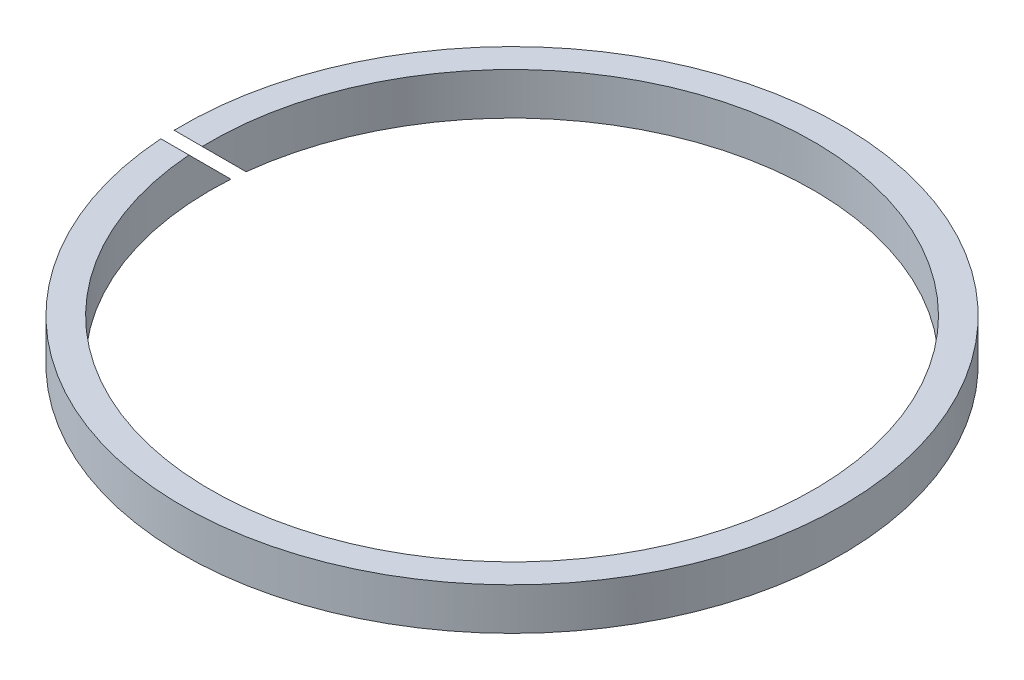
ISO-10303-21;
HEADER;
FILE_DESCRIPTION(('STEP AP214'),'2;1');
FILE_NAME('part.step','',(''),(''),'','','');
FILE_SCHEMA(('AUTOMOTIVE_DESIGN { 1 0 10303 214 1 1 1 1 }'));
ENDSEC;
DATA;
#1=APPLICATION_CONTEXT('core data for automotive mechanical design processes');
#2=APPLICATION_PROTOCOL_DEFINITION('international standard','automotive_design',2000,#1);
#3=PRODUCT_CONTEXT('',#1,'mechanical');
#4=PRODUCT('Part','Part','',(#3));
#5=PRODUCT_RELATED_PRODUCT_CATEGORY('part','',(#4));
#6=PRODUCT_DEFINITION_FORMATION('','',#4);
#7=PRODUCT_DEFINITION_CONTEXT('part definition',#1,'design');
#8=PRODUCT_DEFINITION('design','',#6,#7);
#9=PRODUCT_DEFINITION_SHAPE('','',#8);
#10=(LENGTH_UNIT() NAMED_UNIT(*) SI_UNIT(.MILLI.,.METRE.));
#11=(NAMED_UNIT(*) PLANE_ANGLE_UNIT() SI_UNIT($,.RADIAN.));
#12=(NAMED_UNIT(*) SI_UNIT($,.STERADIAN.) SOLID_ANGLE_UNIT());
#13=UNCERTAINTY_MEASURE_WITH_UNIT(LENGTH_MEASURE(1.E-05),#10,'distance_accuracy_value','');
#14=(GEOMETRIC_REPRESENTATION_CONTEXT(3) GLOBAL_UNCERTAINTY_ASSIGNED_CONTEXT((#13)) GLOBAL_UNIT_ASSIGNED_CONTEXT((#10,
#11,#12)) REPRESENTATION_CONTEXT('',''));
#15=CARTESIAN_POINT('',(0.,0.,0.));
#16=DIRECTION('',(0.,0.,1.));
#17=DIRECTION('',(1.,0.,0.));
#18=AXIS2_PLACEMENT_3D('',#15,#16,#17);
#19=CARTESIAN_POINT('',(0.,1.5,0.));
#20=DIRECTION('',(0.,1.,0.));
#21=DIRECTION('',(0.,0.,1.));
#22=AXIS2_PLACEMENT_3D('',#19,#20,#21);
#23=PLANE('',#22);
#24=DIRECTION('',(1.,0.,0.));
#25=VECTOR('',#24,1.);
#26=CARTESIAN_POINT('',(-23.501,1.5,0.593721188377932));
#27=LINE('',#26,#25);
#28=CARTESIAN_POINT('',(-23.492498699595,1.5,0.593721188377932));
#29=VERTEX_POINT('',#28);
#30=CARTESIAN_POINT('',(-21.4918006493284,1.5,0.593721188377932));
#31=VERTEX_POINT('',#30);
#32=EDGE_CURVE('E74',#29,#31,#27,.T.);
#33=ORIENTED_EDGE('',*,*,#32,.T.);
#34=CARTESIAN_POINT('',(0.,1.5,0.));
#35=DIRECTION('',(0.,1.,0.));
#36=DIRECTION('',(0.,0.,1.));
#37=AXIS2_PLACEMENT_3D('',#34,#35,#36);
#38=CIRCLE('',#37,21.5);
#39=CARTESIAN_POINT('',(-21.4408500944742,1.5,1.59372118837793));
#40=VERTEX_POINT('',#39);
#41=EDGE_CURVE('E84',#40,#31,#38,.T.);
#42=ORIENTED_EDGE('',*,*,#41,.F.);
#43=DIRECTION('',(1.,0.,0.));
#44=VECTOR('',#43,1.);
#45=CARTESIAN_POINT('',(-23.501,1.5,1.59372118837793));
#46=LINE('',#45,#44);
#47=CARTESIAN_POINT('',(-23.4458962885558,1.5,1.59372118837793));
#48=VERTEX_POINT('',#47);
#49=EDGE_CURVE('E56',#48,#40,#46,.T.);
#50=ORIENTED_EDGE('',*,*,#49,.F.);
#51=CARTESIAN_POINT('',(0.,1.5,0.));
#52=DIRECTION('',(0.,1.,0.));
#53=DIRECTION('',(0.,0.,1.));
#54=AXIS2_PLACEMENT_3D('',#51,#52,#53);
#55=CIRCLE('',#54,23.5);
#56=EDGE_CURVE('E11',#48,#29,#55,.T.);
#57=ORIENTED_EDGE('',*,*,#56,.T.);
#58=EDGE_LOOP('',(#33,#42,#50,#57));
#59=FACE_BOUND('',#58,.T.);
#60=ADVANCED_FACE('F33',(#59),#23,.T.);
#61=CARTESIAN_POINT('',(0.,-1.5,0.));
#62=DIRECTION('',(0.,1.,0.));
#63=DIRECTION('',(0.,0.,1.));
#64=AXIS2_PLACEMENT_3D('',#61,#62,#63);
#65=PLANE('',#64);
#66=CARTESIAN_POINT('',(0.,-1.5,0.));
#67=DIRECTION('',(0.,1.,0.));
#68=DIRECTION('',(0.,0.,1.));
#69=AXIS2_PLACEMENT_3D('',#66,#67,#68);
#70=CIRCLE('',#69,21.5);
#71=CARTESIAN_POINT('',(-21.4539595390684,-1.5,-1.40627881162204));
#72=VERTEX_POINT('',#71);
#73=CARTESIAN_POINT('',(-21.3649203668242,-1.5,-2.40627881162204));
#74=VERTEX_POINT('',#73);
#75=EDGE_CURVE('E89',#72,#74,#70,.T.);
#76=ORIENTED_EDGE('',*,*,#75,.T.);
#77=DIRECTION('',(1.,0.,0.));
#78=VECTOR('',#77,1.);
#79=CARTESIAN_POINT('',(-23.501,-1.5,-2.40627881162204));
#80=LINE('',#79,#78);
#81=CARTESIAN_POINT('',(-23.3764801088774,-1.5,-2.40627881162204));
#82=VERTEX_POINT('',#81);
#83=EDGE_CURVE('E48',#82,#74,#80,.T.);
#84=ORIENTED_EDGE('',*,*,#83,.F.);
#85=CARTESIAN_POINT('',(0.,-1.5,0.));
#86=DIRECTION('',(0.,1.,0.));
#87=DIRECTION('',(0.,0.,1.));
#88=AXIS2_PLACEMENT_3D('',#85,#86,#87);
#89=CIRCLE('',#88,23.5);
#90=CARTESIAN_POINT('',(-23.4578852393813,-1.5,-1.40627881162204));
#91=VERTEX_POINT('',#90);
#92=EDGE_CURVE('E37',#91,#82,#89,.T.);
#93=ORIENTED_EDGE('',*,*,#92,.F.);
#94=DIRECTION('',(1.,0.,0.));
#95=VECTOR('',#94,1.);
#96=CARTESIAN_POINT('',(-23.501,-1.5,-1.40627881162204));
#97=LINE('',#96,#95);
#98=EDGE_CURVE('E98',#91,#72,#97,.T.);
#99=ORIENTED_EDGE('',*,*,#98,.T.);
#100=EDGE_LOOP('',(#76,#84,#93,#99));
#101=FACE_BOUND('',#100,.T.);
#102=ADVANCED_FACE('F105',(#101),#65,.F.);
#103=CARTESIAN_POINT('',(0.,1.5,0.));
#104=DIRECTION('',(0.,-1.,0.));
#105=DIRECTION('',(0.,0.,-1.));
#106=AXIS2_PLACEMENT_3D('',#103,#104,#105);
#107=CYLINDRICAL_SURFACE('',#106,23.5);
#108=ORIENTED_EDGE('',*,*,#92,.T.);
#109=CARTESIAN_POINT('',(0.,0.906278811622062,0.));
#110=DIRECTION('',(0.,0.707106781186544,-0.707106781186551));
#111=DIRECTION('',(0.,-0.707106781186551,-0.707106781186544));
#112=AXIS2_PLACEMENT_3D('',#109,#110,#111);
#113=ELLIPSE('',#112,33.2340187157679,23.5);
#114=EDGE_CURVE('E80',#29,#82,#113,.F.);
#115=ORIENTED_EDGE('',*,*,#114,.F.);
#116=ORIENTED_EDGE('',*,*,#56,.F.);
#117=CARTESIAN_POINT('',(0.,-0.0937211883779473,0.));
#118=DIRECTION('',(0.,-0.707106781186544,0.707106781186551));
#119=DIRECTION('',(0.,-0.707106781186551,-0.707106781186544));
#120=AXIS2_PLACEMENT_3D('',#117,#118,#119);
#121=ELLIPSE('',#120,33.2340187157679,23.5);
#122=EDGE_CURVE('E92',#91,#48,#121,.F.);
#123=ORIENTED_EDGE('',*,*,#122,.F.);
#124=EDGE_LOOP('',(#108,#115,#116,#123));
#125=FACE_BOUND('',#124,.T.);
#126=ADVANCED_FACE('F35',(#125),#107,.T.);
#127=CARTESIAN_POINT('',(0.,1.5,0.));
#128=DIRECTION('',(0.,-1.,0.));
#129=DIRECTION('',(0.,0.,-1.));
#130=AXIS2_PLACEMENT_3D('',#127,#128,#129);
#131=CYLINDRICAL_SURFACE('',#130,21.5);
#132=CARTESIAN_POINT('',(0.,0.906278811622062,0.));
#133=DIRECTION('',(0.,0.707106781186544,-0.707106781186551));
#134=DIRECTION('',(0.,-0.707106781186551,-0.707106781186544));
#135=AXIS2_PLACEMENT_3D('',#132,#133,#134);
#136=ELLIPSE('',#135,30.4055915910217,21.5);
#137=EDGE_CURVE('E71',#31,#74,#136,.F.);
#138=ORIENTED_EDGE('',*,*,#137,.T.);
#139=ORIENTED_EDGE('',*,*,#75,.F.);
#140=CARTESIAN_POINT('',(0.,-0.0937211883779473,0.));
#141=DIRECTION('',(0.,-0.707106781186544,0.707106781186551));
#142=DIRECTION('',(0.,-0.707106781186551,-0.707106781186544));
#143=AXIS2_PLACEMENT_3D('',#140,#141,#142);
#144=ELLIPSE('',#143,30.4055915910217,21.5);
#145=EDGE_CURVE('E86',#72,#40,#144,.F.);
#146=ORIENTED_EDGE('',*,*,#145,.T.);
#147=ORIENTED_EDGE('',*,*,#41,.T.);
#148=EDGE_LOOP('',(#138,#139,#146,#147));
#149=FACE_BOUND('',#148,.T.);
#150=ADVANCED_FACE('F88',(#149),#131,.F.);
#151=CARTESIAN_POINT('',(-23.501,1.5,1.59372118837793));
#152=DIRECTION('',(0.,-0.707106781186544,0.707106781186551));
#153=DIRECTION('',(0.,-0.707106781186551,-0.707106781186544));
#154=AXIS2_PLACEMENT_3D('',#151,#152,#153);
#155=PLANE('',#154);
#156=ORIENTED_EDGE('',*,*,#122,.T.);
#157=ORIENTED_EDGE('',*,*,#49,.T.);
#158=ORIENTED_EDGE('',*,*,#145,.F.);
#159=ORIENTED_EDGE('',*,*,#98,.F.);
#160=EDGE_LOOP('',(#156,#157,#158,#159));
#161=FACE_BOUND('',#160,.T.);
#162=ADVANCED_FACE('F107',(#161),#155,.F.);
#163=CARTESIAN_POINT('',(-23.501,-1.5,-2.40627881162204));
#164=DIRECTION('',(0.,0.707106781186544,-0.707106781186551));
#165=DIRECTION('',(0.,0.707106781186551,0.707106781186544));
#166=AXIS2_PLACEMENT_3D('',#163,#164,#165);
#167=PLANE('',#166);
#168=ORIENTED_EDGE('',*,*,#114,.T.);
#169=ORIENTED_EDGE('',*,*,#83,.T.);
#170=ORIENTED_EDGE('',*,*,#137,.F.);
#171=ORIENTED_EDGE('',*,*,#32,.F.);
#172=EDGE_LOOP('',(#168,#169,#170,#171));
#173=FACE_BOUND('',#172,.T.);
#174=ADVANCED_FACE('F73',(#173),#167,.F.);
#175=CLOSED_SHELL('',(#60,#102,#126,#150,#162,#174));
#176=MANIFOLD_SOLID_BREP('B2',#175);
#177=ADVANCED_BREP_SHAPE_REPRESENTATION('',(#18,#176),#14);
#178=SHAPE_DEFINITION_REPRESENTATION(#9,#177);
ENDSEC;
END-ISO-10303-21;
